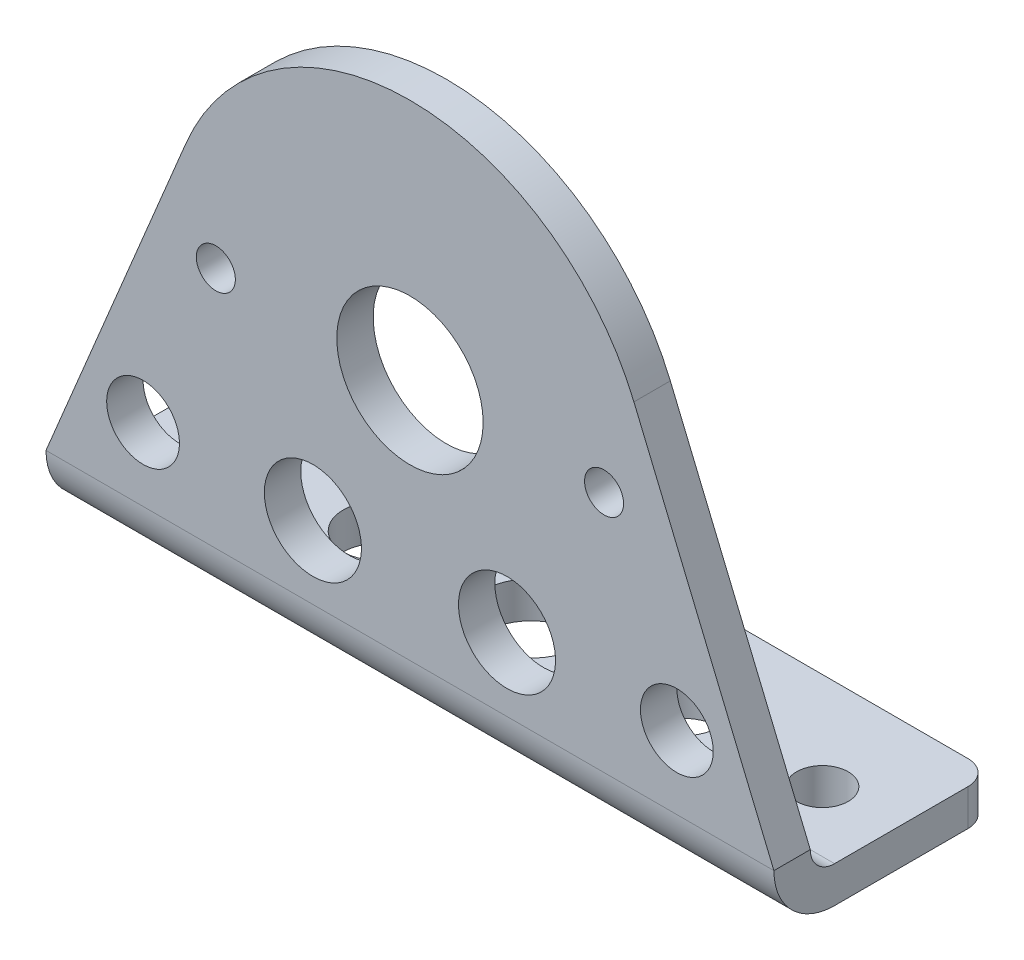
ISO-10303-21;
HEADER;
FILE_DESCRIPTION(('STEP AP214'),'2;1');
FILE_NAME('part.step','',(''),(''),'','','');
FILE_SCHEMA(('AUTOMOTIVE_DESIGN { 1 0 10303 214 1 1 1 1 }'));
ENDSEC;
DATA;
#1=APPLICATION_CONTEXT('core data for automotive mechanical design processes');
#2=APPLICATION_PROTOCOL_DEFINITION('international standard','automotive_design',2000,#1);
#3=PRODUCT_CONTEXT('',#1,'mechanical');
#4=PRODUCT('Part','Part','',(#3));
#5=PRODUCT_RELATED_PRODUCT_CATEGORY('part','',(#4));
#6=PRODUCT_DEFINITION_FORMATION('','',#4);
#7=PRODUCT_DEFINITION_CONTEXT('part definition',#1,'design');
#8=PRODUCT_DEFINITION('design','',#6,#7);
#9=PRODUCT_DEFINITION_SHAPE('','',#8);
#10=(LENGTH_UNIT() NAMED_UNIT(*) SI_UNIT(.MILLI.,.METRE.));
#11=(NAMED_UNIT(*) PLANE_ANGLE_UNIT() SI_UNIT($,.RADIAN.));
#12=(NAMED_UNIT(*) SI_UNIT($,.STERADIAN.) SOLID_ANGLE_UNIT());
#13=UNCERTAINTY_MEASURE_WITH_UNIT(LENGTH_MEASURE(1.E-05),#10,'distance_accuracy_value','');
#14=(GEOMETRIC_REPRESENTATION_CONTEXT(3) GLOBAL_UNCERTAINTY_ASSIGNED_CONTEXT((#13)) GLOBAL_UNIT_ASSIGNED_CONTEXT((#10,
#11,#12)) REPRESENTATION_CONTEXT('',''));
#15=CARTESIAN_POINT('',(0.,0.,0.));
#16=DIRECTION('',(0.,0.,1.));
#17=DIRECTION('',(1.,0.,0.));
#18=AXIS2_PLACEMENT_3D('',#15,#16,#17);
#19=CARTESIAN_POINT('',(47.625,-34.925,-4.7625));
#20=DIRECTION('',(0.,1.,0.));
#21=DIRECTION('',(0.,0.,1.));
#22=AXIS2_PLACEMENT_3D('',#19,#20,#21);
#23=PLANE('',#22);
#24=DIRECTION('',(0.,0.,1.));
#25=VECTOR('',#24,1.);
#26=CARTESIAN_POINT('',(47.625,-34.925,-4.76249999999998));
#27=LINE('',#26,#25);
#28=CARTESIAN_POINT('',(47.625,-34.925,-7.93749999999999));
#29=VERTEX_POINT('',#28);
#30=CARTESIAN_POINT('',(47.625,-34.925,-25.4));
#31=VERTEX_POINT('',#30);
#32=EDGE_CURVE('E95',#29,#31,#27,.F.);
#33=ORIENTED_EDGE('',*,*,#32,.T.);
#34=CARTESIAN_POINT('',(44.45,-34.9250000000001,-25.4));
#35=DIRECTION('',(0.,1.,0.));
#36=DIRECTION('',(0.,0.,1.));
#37=AXIS2_PLACEMENT_3D('',#34,#35,#36);
#38=CIRCLE('',#37,3.175);
#39=CARTESIAN_POINT('',(44.45,-34.9250000000001,-28.575));
#40=VERTEX_POINT('',#39);
#41=EDGE_CURVE('E89',#40,#31,#38,.F.);
#42=ORIENTED_EDGE('',*,*,#41,.F.);
#43=DIRECTION('',(1.,0.,0.));
#44=VECTOR('',#43,1.);
#45=CARTESIAN_POINT('',(47.625,-34.9250000000001,-28.575));
#46=LINE('',#45,#44);
#47=CARTESIAN_POINT('',(-44.45,-34.9250000000001,-28.575));
#48=VERTEX_POINT('',#47);
#49=EDGE_CURVE('E92',#40,#48,#46,.F.);
#50=ORIENTED_EDGE('',*,*,#49,.T.);
#51=CARTESIAN_POINT('',(-44.45,-34.9250000000001,-25.4));
#52=DIRECTION('',(0.,1.,0.));
#53=DIRECTION('',(0.,0.,1.));
#54=AXIS2_PLACEMENT_3D('',#51,#52,#53);
#55=CIRCLE('',#54,3.175);
#56=CARTESIAN_POINT('',(-47.625,-34.9250000000001,-25.4));
#57=VERTEX_POINT('',#56);
#58=EDGE_CURVE('E107',#57,#48,#55,.F.);
#59=ORIENTED_EDGE('',*,*,#58,.F.);
#60=DIRECTION('',(0.,0.,-1.));
#61=VECTOR('',#60,1.);
#62=CARTESIAN_POINT('',(-47.625,-34.9250000000001,-28.575));
#63=LINE('',#62,#61);
#64=CARTESIAN_POINT('',(-47.625,-34.925,-7.93749999999999));
#65=VERTEX_POINT('',#64);
#66=EDGE_CURVE('E120',#57,#65,#63,.F.);
#67=ORIENTED_EDGE('',*,*,#66,.T.);
#68=DIRECTION('',(-1.,0.,0.));
#69=VECTOR('',#68,1.);
#70=CARTESIAN_POINT('',(-47.625,-34.925,-7.93749999999999));
#71=LINE('',#70,#69);
#72=EDGE_CURVE('E119',#65,#29,#71,.F.);
#73=ORIENTED_EDGE('',*,*,#72,.T.);
#74=EDGE_LOOP('',(#33,#42,#50,#59,#67,#73));
#75=FACE_BOUND('',#74,.T.);
#76=CARTESIAN_POINT('',(-38.1,-34.925,-15.875));
#77=DIRECTION('',(0.,1.,0.));
#78=DIRECTION('',(0.,0.,1.));
#79=AXIS2_PLACEMENT_3D('',#76,#77,#78);
#80=CIRCLE('',#79,3.37350099999998);
#81=CARTESIAN_POINT('',(-38.1,-34.925,-12.501499));
#82=VERTEX_POINT('',#81);
#83=EDGE_CURVE('E100',#82,#82,#80,.F.);
#84=ORIENTED_EDGE('',*,*,#83,.T.);
#85=EDGE_LOOP('',(#84));
#86=FACE_BOUND('',#85,.T.);
#87=CARTESIAN_POINT('',(38.1,-34.925,-15.875));
#88=DIRECTION('',(0.,1.,0.));
#89=DIRECTION('',(0.,0.,1.));
#90=AXIS2_PLACEMENT_3D('',#87,#88,#89);
#91=CIRCLE('',#90,3.37350099999999);
#92=CARTESIAN_POINT('',(38.1,-34.925,-12.501499));
#93=VERTEX_POINT('',#92);
#94=EDGE_CURVE('E211',#93,#93,#91,.F.);
#95=ORIENTED_EDGE('',*,*,#94,.T.);
#96=EDGE_LOOP('',(#95));
#97=FACE_BOUND('',#96,.T.);
#98=CARTESIAN_POINT('',(0.,-34.925,-15.875));
#99=DIRECTION('',(0.,1.,0.));
#100=DIRECTION('',(0.,0.,1.));
#101=AXIS2_PLACEMENT_3D('',#98,#99,#100);
#102=CIRCLE('',#101,6.35);
#103=CARTESIAN_POINT('',(0.,-34.925,-9.525));
#104=VERTEX_POINT('',#103);
#105=EDGE_CURVE('E214',#104,#104,#102,.F.);
#106=ORIENTED_EDGE('',*,*,#105,.T.);
#107=EDGE_LOOP('',(#106));
#108=FACE_BOUND('',#107,.T.);
#109=CARTESIAN_POINT('',(-19.84375,-34.925,-15.875));
#110=DIRECTION('',(0.,1.,0.));
#111=DIRECTION('',(0.,0.,1.));
#112=AXIS2_PLACEMENT_3D('',#109,#110,#111);
#113=CIRCLE('',#112,4.7625);
#114=CARTESIAN_POINT('',(-19.84375,-34.925,-11.1125));
#115=VERTEX_POINT('',#114);
#116=EDGE_CURVE('E216',#115,#115,#113,.F.);
#117=ORIENTED_EDGE('',*,*,#116,.T.);
#118=EDGE_LOOP('',(#117));
#119=FACE_BOUND('',#118,.T.);
#120=CARTESIAN_POINT('',(19.84375,-34.925,-15.875));
#121=DIRECTION('',(0.,1.,0.));
#122=DIRECTION('',(0.,0.,1.));
#123=AXIS2_PLACEMENT_3D('',#120,#121,#122);
#124=CIRCLE('',#123,4.76250000000001);
#125=CARTESIAN_POINT('',(19.84375,-34.925,-11.1125));
#126=VERTEX_POINT('',#125);
#127=EDGE_CURVE('E20',#126,#126,#124,.F.);
#128=ORIENTED_EDGE('',*,*,#127,.T.);
#129=EDGE_LOOP('',(#128));
#130=FACE_BOUND('',#129,.T.);
#131=ADVANCED_FACE('F17',(#75,#86,#97,#108,#119,#130),#23,.T.);
#132=CARTESIAN_POINT('',(19.84375,-39.6875000000001,-15.875));
#133=DIRECTION('',(0.,1.,0.));
#134=DIRECTION('',(0.,0.,1.));
#135=AXIS2_PLACEMENT_3D('',#132,#133,#134);
#136=CYLINDRICAL_SURFACE('',#135,4.76250000000001);
#137=CARTESIAN_POINT('',(19.84375,-39.6875000000001,-15.875));
#138=DIRECTION('',(0.,1.,0.));
#139=DIRECTION('',(0.,0.,1.));
#140=AXIS2_PLACEMENT_3D('',#137,#138,#139);
#141=CIRCLE('',#140,4.76250000000001);
#142=CARTESIAN_POINT('',(19.84375,-39.6875000000001,-11.1125));
#143=VERTEX_POINT('',#142);
#144=EDGE_CURVE('E201',#143,#143,#141,.F.);
#145=ORIENTED_EDGE('',*,*,#144,.T.);
#146=EDGE_LOOP('',(#145));
#147=FACE_BOUND('',#146,.T.);
#148=ORIENTED_EDGE('',*,*,#127,.F.);
#149=EDGE_LOOP('',(#148));
#150=FACE_BOUND('',#149,.T.);
#151=ADVANCED_FACE('F224',(#147,#150),#136,.F.);
#152=CARTESIAN_POINT('',(-19.84375,-39.6875000000001,-15.875));
#153=DIRECTION('',(0.,1.,0.));
#154=DIRECTION('',(0.,0.,1.));
#155=AXIS2_PLACEMENT_3D('',#152,#153,#154);
#156=CYLINDRICAL_SURFACE('',#155,4.7625);
#157=CARTESIAN_POINT('',(-19.84375,-39.6875000000001,-15.875));
#158=DIRECTION('',(0.,1.,0.));
#159=DIRECTION('',(0.,0.,1.));
#160=AXIS2_PLACEMENT_3D('',#157,#158,#159);
#161=CIRCLE('',#160,4.7625);
#162=CARTESIAN_POINT('',(-19.84375,-39.6875000000001,-11.1125));
#163=VERTEX_POINT('',#162);
#164=EDGE_CURVE('E198',#163,#163,#161,.F.);
#165=ORIENTED_EDGE('',*,*,#164,.T.);
#166=EDGE_LOOP('',(#165));
#167=FACE_BOUND('',#166,.T.);
#168=ORIENTED_EDGE('',*,*,#116,.F.);
#169=EDGE_LOOP('',(#168));
#170=FACE_BOUND('',#169,.T.);
#171=ADVANCED_FACE('F226',(#167,#170),#156,.F.);
#172=CARTESIAN_POINT('',(0.,-39.6875000000001,-15.875));
#173=DIRECTION('',(0.,1.,0.));
#174=DIRECTION('',(0.,0.,1.));
#175=AXIS2_PLACEMENT_3D('',#172,#173,#174);
#176=CYLINDRICAL_SURFACE('',#175,6.35);
#177=CARTESIAN_POINT('',(0.,-39.6875000000001,-15.875));
#178=DIRECTION('',(0.,1.,0.));
#179=DIRECTION('',(0.,0.,1.));
#180=AXIS2_PLACEMENT_3D('',#177,#178,#179);
#181=CIRCLE('',#180,6.35);
#182=CARTESIAN_POINT('',(0.,-39.6875000000001,-9.52499999999999));
#183=VERTEX_POINT('',#182);
#184=EDGE_CURVE('E195',#183,#183,#181,.F.);
#185=ORIENTED_EDGE('',*,*,#184,.T.);
#186=EDGE_LOOP('',(#185));
#187=FACE_BOUND('',#186,.T.);
#188=ORIENTED_EDGE('',*,*,#105,.F.);
#189=EDGE_LOOP('',(#188));
#190=FACE_BOUND('',#189,.T.);
#191=ADVANCED_FACE('F233',(#187,#190),#176,.F.);
#192=CARTESIAN_POINT('',(38.1,-34.925,-15.875));
#193=DIRECTION('',(0.,1.,0.));
#194=DIRECTION('',(0.,0.,1.));
#195=AXIS2_PLACEMENT_3D('',#192,#193,#194);
#196=CYLINDRICAL_SURFACE('',#195,3.37350099999999);
#197=CARTESIAN_POINT('',(38.1,-39.6875,-15.875));
#198=DIRECTION('',(0.,1.,0.));
#199=DIRECTION('',(0.,0.,1.));
#200=AXIS2_PLACEMENT_3D('',#197,#198,#199);
#201=CIRCLE('',#200,3.37350099999999);
#202=CARTESIAN_POINT('',(38.1,-39.6875,-12.501499));
#203=VERTEX_POINT('',#202);
#204=EDGE_CURVE('E192',#203,#203,#201,.F.);
#205=ORIENTED_EDGE('',*,*,#204,.T.);
#206=EDGE_LOOP('',(#205));
#207=FACE_BOUND('',#206,.T.);
#208=ORIENTED_EDGE('',*,*,#94,.F.);
#209=EDGE_LOOP('',(#208));
#210=FACE_BOUND('',#209,.T.);
#211=ADVANCED_FACE('F319',(#207,#210),#196,.F.);
#212=CARTESIAN_POINT('',(-38.1,-34.925,-15.875));
#213=DIRECTION('',(0.,1.,0.));
#214=DIRECTION('',(0.,0.,1.));
#215=AXIS2_PLACEMENT_3D('',#212,#213,#214);
#216=CYLINDRICAL_SURFACE('',#215,3.37350099999998);
#217=CARTESIAN_POINT('',(-38.1,-39.6875,-15.875));
#218=DIRECTION('',(0.,1.,0.));
#219=DIRECTION('',(0.,0.,1.));
#220=AXIS2_PLACEMENT_3D('',#217,#218,#219);
#221=CIRCLE('',#220,3.37350099999998);
#222=CARTESIAN_POINT('',(-38.1,-39.6875,-12.501499));
#223=VERTEX_POINT('',#222);
#224=EDGE_CURVE('E189',#223,#223,#221,.F.);
#225=ORIENTED_EDGE('',*,*,#224,.T.);
#226=EDGE_LOOP('',(#225));
#227=FACE_BOUND('',#226,.T.);
#228=ORIENTED_EDGE('',*,*,#83,.F.);
#229=EDGE_LOOP('',(#228));
#230=FACE_BOUND('',#229,.T.);
#231=ADVANCED_FACE('F316',(#227,#230),#216,.F.);
#232=CARTESIAN_POINT('',(44.45,-39.6875000000001,-25.4));
#233=DIRECTION('',(0.,1.,0.));
#234=DIRECTION('',(0.,0.,1.));
#235=AXIS2_PLACEMENT_3D('',#232,#233,#234);
#236=CYLINDRICAL_SURFACE('',#235,3.175);
#237=ORIENTED_EDGE('',*,*,#41,.T.);
#238=DIRECTION('',(0.,1.,0.));
#239=VECTOR('',#238,1.);
#240=CARTESIAN_POINT('',(47.625,-39.6875,-25.4));
#241=LINE('',#240,#239);
#242=CARTESIAN_POINT('',(47.625,-39.6875000000001,-25.4));
#243=VERTEX_POINT('',#242);
#244=EDGE_CURVE('E117',#31,#243,#241,.F.);
#245=ORIENTED_EDGE('',*,*,#244,.T.);
#246=CARTESIAN_POINT('',(44.45,-39.6875000000001,-25.4));
#247=DIRECTION('',(0.,1.,0.));
#248=DIRECTION('',(0.,0.,1.));
#249=AXIS2_PLACEMENT_3D('',#246,#247,#248);
#250=CIRCLE('',#249,3.175);
#251=CARTESIAN_POINT('',(44.45,-39.6875000000001,-28.575));
#252=VERTEX_POINT('',#251);
#253=EDGE_CURVE('E112',#243,#252,#250,.T.);
#254=ORIENTED_EDGE('',*,*,#253,.T.);
#255=DIRECTION('',(0.,-1.,0.));
#256=VECTOR('',#255,1.);
#257=CARTESIAN_POINT('',(44.45,-39.6875000000001,-28.575));
#258=LINE('',#257,#256);
#259=EDGE_CURVE('E99',#252,#40,#258,.F.);
#260=ORIENTED_EDGE('',*,*,#259,.T.);
#261=EDGE_LOOP('',(#237,#245,#254,#260));
#262=FACE_BOUND('',#261,.T.);
#263=ADVANCED_FACE('F110',(#262),#236,.T.);
#264=CARTESIAN_POINT('',(47.625,-39.6875000000001,-28.575));
#265=DIRECTION('',(0.,0.,1.));
#266=DIRECTION('',(0.,-1.,0.));
#267=AXIS2_PLACEMENT_3D('',#264,#265,#266);
#268=PLANE('',#267);
#269=DIRECTION('',(0.,1.,0.));
#270=VECTOR('',#269,1.);
#271=CARTESIAN_POINT('',(-44.45,-39.6875000000001,-28.575));
#272=LINE('',#271,#270);
#273=CARTESIAN_POINT('',(-44.45,-39.6875000000001,-28.575));
#274=VERTEX_POINT('',#273);
#275=EDGE_CURVE('E106',#48,#274,#272,.F.);
#276=ORIENTED_EDGE('',*,*,#275,.F.);
#277=ORIENTED_EDGE('',*,*,#49,.F.);
#278=ORIENTED_EDGE('',*,*,#259,.F.);
#279=DIRECTION('',(1.,0.,0.));
#280=VECTOR('',#279,1.);
#281=CARTESIAN_POINT('',(47.625,-39.6875000000001,-28.575));
#282=LINE('',#281,#280);
#283=EDGE_CURVE('E186',#252,#274,#282,.F.);
#284=ORIENTED_EDGE('',*,*,#283,.T.);
#285=EDGE_LOOP('',(#276,#277,#278,#284));
#286=FACE_BOUND('',#285,.T.);
#287=ADVANCED_FACE('F103',(#286),#268,.F.);
#288=CARTESIAN_POINT('',(-44.45,-39.6875000000001,-25.4));
#289=DIRECTION('',(0.,1.,0.));
#290=DIRECTION('',(0.,0.,1.));
#291=AXIS2_PLACEMENT_3D('',#288,#289,#290);
#292=CYLINDRICAL_SURFACE('',#291,3.175);
#293=ORIENTED_EDGE('',*,*,#58,.T.);
#294=ORIENTED_EDGE('',*,*,#275,.T.);
#295=CARTESIAN_POINT('',(-44.45,-39.6875000000001,-25.4));
#296=DIRECTION('',(0.,1.,0.));
#297=DIRECTION('',(0.,0.,1.));
#298=AXIS2_PLACEMENT_3D('',#295,#296,#297);
#299=CIRCLE('',#298,3.175);
#300=CARTESIAN_POINT('',(-47.625,-39.6875000000001,-25.4));
#301=VERTEX_POINT('',#300);
#302=EDGE_CURVE('E183',#274,#301,#299,.T.);
#303=ORIENTED_EDGE('',*,*,#302,.T.);
#304=DIRECTION('',(0.,1.,0.));
#305=VECTOR('',#304,1.);
#306=CARTESIAN_POINT('',(-47.625,-39.6875000000001,-25.4));
#307=LINE('',#306,#305);
#308=EDGE_CURVE('E122',#301,#57,#307,.T.);
#309=ORIENTED_EDGE('',*,*,#308,.T.);
#310=EDGE_LOOP('',(#293,#294,#303,#309));
#311=FACE_BOUND('',#310,.T.);
#312=ADVANCED_FACE('F307',(#311),#292,.T.);
#313=CARTESIAN_POINT('',(-47.625,-31.75,-7.9375));
#314=DIRECTION('',(-1.,0.,0.));
#315=DIRECTION('',(0.,0.,1.));
#316=AXIS2_PLACEMENT_3D('',#313,#314,#315);
#317=CYLINDRICAL_SURFACE('',#316,3.175);
#318=CARTESIAN_POINT('',(47.625,-31.75,-7.9375));
#319=DIRECTION('',(-1.,0.,0.));
#320=DIRECTION('',(0.,0.,1.));
#321=AXIS2_PLACEMENT_3D('',#318,#319,#320);
#322=CIRCLE('',#321,3.175);
#323=CARTESIAN_POINT('',(47.625,-31.75,-4.7625));
#324=VERTEX_POINT('',#323);
#325=EDGE_CURVE('E180',#29,#324,#322,.T.);
#326=ORIENTED_EDGE('',*,*,#325,.F.);
#327=ORIENTED_EDGE('',*,*,#72,.F.);
#328=CARTESIAN_POINT('',(-47.625,-31.75,-7.9375));
#329=DIRECTION('',(-1.,0.,0.));
#330=DIRECTION('',(0.,0.,1.));
#331=AXIS2_PLACEMENT_3D('',#328,#329,#330);
#332=CIRCLE('',#331,3.175);
#333=CARTESIAN_POINT('',(-47.625,-31.75,-4.7625));
#334=VERTEX_POINT('',#333);
#335=EDGE_CURVE('E204',#65,#334,#332,.T.);
#336=ORIENTED_EDGE('',*,*,#335,.T.);
#337=DIRECTION('',(-1.,0.,0.));
#338=VECTOR('',#337,1.);
#339=CARTESIAN_POINT('',(0.,-31.75,-4.7625));
#340=LINE('',#339,#338);
#341=EDGE_CURVE('E207',#324,#334,#340,.T.);
#342=ORIENTED_EDGE('',*,*,#341,.F.);
#343=EDGE_LOOP('',(#326,#327,#336,#342));
#344=FACE_BOUND('',#343,.T.);
#345=ADVANCED_FACE('F303',(#344),#317,.F.);
#346=CARTESIAN_POINT('',(0.,0.,-4.7625));
#347=DIRECTION('',(0.,0.,-1.));
#348=DIRECTION('',(-1.,0.,0.));
#349=AXIS2_PLACEMENT_3D('',#346,#347,#348);
#350=PLANE('',#349);
#351=DIRECTION('',(-0.384615384615385,-0.923076923076923,0.));
#352=VECTOR('',#351,1.);
#353=CARTESIAN_POINT('',(-47.625,-31.75,-4.7625));
#354=LINE('',#353,#352);
#355=CARTESIAN_POINT('',(-29.3076923076923,12.2115384615385,-4.7625));
#356=VERTEX_POINT('',#355);
#357=EDGE_CURVE('E161',#356,#334,#354,.T.);
#358=ORIENTED_EDGE('',*,*,#357,.F.);
#359=CARTESIAN_POINT('',(0.,0.,-4.7625));
#360=DIRECTION('',(0.,0.,1.));
#361=DIRECTION('',(1.,0.,0.));
#362=AXIS2_PLACEMENT_3D('',#359,#360,#361);
#363=CIRCLE('',#362,31.75);
#364=CARTESIAN_POINT('',(29.3076923076923,12.2115384615385,-4.7625));
#365=VERTEX_POINT('',#364);
#366=EDGE_CURVE('E154',#365,#356,#363,.T.);
#367=ORIENTED_EDGE('',*,*,#366,.F.);
#368=DIRECTION('',(-0.384615384615385,0.923076923076923,0.));
#369=VECTOR('',#368,1.);
#370=CARTESIAN_POINT('',(47.625,-31.75,-4.7625));
#371=LINE('',#370,#369);
#372=EDGE_CURVE('E524',#324,#365,#371,.T.);
#373=ORIENTED_EDGE('',*,*,#372,.F.);
#374=ORIENTED_EDGE('',*,*,#341,.T.);
#375=EDGE_LOOP('',(#358,#367,#373,#374));
#376=FACE_BOUND('',#375,.T.);
#377=CARTESIAN_POINT('',(-25.4,0.,-4.7625));
#378=DIRECTION('',(0.,0.,1.));
#379=DIRECTION('',(1.,0.,0.));
#380=AXIS2_PLACEMENT_3D('',#377,#378,#379);
#381=CIRCLE('',#380,2.5527);
#382=CARTESIAN_POINT('',(-22.8473,0.,-4.7625));
#383=VERTEX_POINT('',#382);
#384=EDGE_CURVE('E158',#383,#383,#381,.T.);
#385=ORIENTED_EDGE('',*,*,#384,.T.);
#386=EDGE_LOOP('',(#385));
#387=FACE_BOUND('',#386,.T.);
#388=CARTESIAN_POINT('',(25.4,0.,-4.7625));
#389=DIRECTION('',(0.,0.,1.));
#390=DIRECTION('',(1.,0.,0.));
#391=AXIS2_PLACEMENT_3D('',#388,#389,#390);
#392=CIRCLE('',#391,2.5527);
#393=CARTESIAN_POINT('',(27.9527,0.,-4.7625));
#394=VERTEX_POINT('',#393);
#395=EDGE_CURVE('E162',#394,#394,#392,.T.);
#396=ORIENTED_EDGE('',*,*,#395,.T.);
#397=EDGE_LOOP('',(#396));
#398=FACE_BOUND('',#397,.T.);
#399=CARTESIAN_POINT('',(0.,0.,-4.7625));
#400=DIRECTION('',(0.,0.,1.));
#401=DIRECTION('',(1.,0.,0.));
#402=AXIS2_PLACEMENT_3D('',#399,#400,#401);
#403=CIRCLE('',#402,9.5758);
#404=CARTESIAN_POINT('',(9.5758,0.,-4.7625));
#405=VERTEX_POINT('',#404);
#406=EDGE_CURVE('E165',#405,#405,#403,.T.);
#407=ORIENTED_EDGE('',*,*,#406,.T.);
#408=EDGE_LOOP('',(#407));
#409=FACE_BOUND('',#408,.T.);
#410=CARTESIAN_POINT('',(-12.7,-22.225,-4.7625));
#411=DIRECTION('',(0.,0.,-1.));
#412=DIRECTION('',(-1.,0.,0.));
#413=AXIS2_PLACEMENT_3D('',#410,#411,#412);
#414=CIRCLE('',#413,6.35);
#415=CARTESIAN_POINT('',(-19.05,-22.225,-4.7625));
#416=VERTEX_POINT('',#415);
#417=EDGE_CURVE('E168',#416,#416,#414,.F.);
#418=ORIENTED_EDGE('',*,*,#417,.T.);
#419=EDGE_LOOP('',(#418));
#420=FACE_BOUND('',#419,.T.);
#421=CARTESIAN_POINT('',(12.7,-22.225,-4.7625));
#422=DIRECTION('',(0.,0.,-1.));
#423=DIRECTION('',(-1.,0.,0.));
#424=AXIS2_PLACEMENT_3D('',#421,#422,#423);
#425=CIRCLE('',#424,6.35);
#426=CARTESIAN_POINT('',(6.35,-22.225,-4.7625));
#427=VERTEX_POINT('',#426);
#428=EDGE_CURVE('E171',#427,#427,#425,.F.);
#429=ORIENTED_EDGE('',*,*,#428,.T.);
#430=EDGE_LOOP('',(#429));
#431=FACE_BOUND('',#430,.T.);
#432=CARTESIAN_POINT('',(34.925,-22.225,-4.7625));
#433=DIRECTION('',(0.,0.,-1.));
#434=DIRECTION('',(-1.,0.,0.));
#435=AXIS2_PLACEMENT_3D('',#432,#433,#434);
#436=CIRCLE('',#435,4.7625);
#437=CARTESIAN_POINT('',(30.1625,-22.225,-4.7625));
#438=VERTEX_POINT('',#437);
#439=EDGE_CURVE('E174',#438,#438,#436,.F.);
#440=ORIENTED_EDGE('',*,*,#439,.T.);
#441=EDGE_LOOP('',(#440));
#442=FACE_BOUND('',#441,.T.);
#443=CARTESIAN_POINT('',(-34.925,-22.225,-4.7625));
#444=DIRECTION('',(0.,0.,-1.));
#445=DIRECTION('',(-1.,0.,0.));
#446=AXIS2_PLACEMENT_3D('',#443,#444,#445);
#447=CIRCLE('',#446,4.7625);
#448=CARTESIAN_POINT('',(-39.6875,-22.225,-4.7625));
#449=VERTEX_POINT('',#448);
#450=EDGE_CURVE('E177',#449,#449,#447,.F.);
#451=ORIENTED_EDGE('',*,*,#450,.T.);
#452=EDGE_LOOP('',(#451));
#453=FACE_BOUND('',#452,.T.);
#454=ADVANCED_FACE('F299',(#376,#387,#398,#409,#420,#431,#442,#453),#350,.T.);
#455=CARTESIAN_POINT('',(-47.625,-31.75,-7.9375));
#456=DIRECTION('',(1.,0.,0.));
#457=DIRECTION('',(0.,0.,-1.));
#458=AXIS2_PLACEMENT_3D('',#455,#456,#457);
#459=PLANE('',#458);
#460=ORIENTED_EDGE('',*,*,#335,.F.);
#461=ORIENTED_EDGE('',*,*,#66,.F.);
#462=ORIENTED_EDGE('',*,*,#308,.F.);
#463=DIRECTION('',(0.,0.,1.));
#464=VECTOR('',#463,1.);
#465=CARTESIAN_POINT('',(-47.625,-39.6875,-4.76249999999998));
#466=LINE('',#465,#464);
#467=CARTESIAN_POINT('',(-47.625,-39.6875,-7.93749999999998));
#468=VERTEX_POINT('',#467);
#469=EDGE_CURVE('E182',#301,#468,#466,.T.);
#470=ORIENTED_EDGE('',*,*,#469,.T.);
#471=CARTESIAN_POINT('',(-47.625,-31.75,-7.9375));
#472=DIRECTION('',(-1.,0.,0.));
#473=DIRECTION('',(0.,0.,1.));
#474=AXIS2_PLACEMENT_3D('',#471,#472,#473);
#475=CIRCLE('',#474,7.9375);
#476=CARTESIAN_POINT('',(-47.625,-31.75,0.));
#477=VERTEX_POINT('',#476);
#478=EDGE_CURVE('E151',#477,#468,#475,.F.);
#479=ORIENTED_EDGE('',*,*,#478,.F.);
#480=DIRECTION('',(0.,0.,1.));
#481=VECTOR('',#480,1.);
#482=CARTESIAN_POINT('',(-47.625,-31.75,-4.7625));
#483=LINE('',#482,#481);
#484=EDGE_CURVE('E157',#334,#477,#483,.T.);
#485=ORIENTED_EDGE('',*,*,#484,.F.);
#486=EDGE_LOOP('',(#460,#461,#462,#470,#479,#485));
#487=FACE_BOUND('',#486,.T.);
#488=ADVANCED_FACE('F295',(#487),#459,.F.);
#489=CARTESIAN_POINT('',(47.625,-39.6875,-4.76249999999998));
#490=DIRECTION('',(0.,1.,0.));
#491=DIRECTION('',(0.,0.,1.));
#492=AXIS2_PLACEMENT_3D('',#489,#490,#491);
#493=PLANE('',#492);
#494=ORIENTED_EDGE('',*,*,#302,.F.);
#495=ORIENTED_EDGE('',*,*,#283,.F.);
#496=ORIENTED_EDGE('',*,*,#253,.F.);
#497=DIRECTION('',(0.,0.,1.));
#498=VECTOR('',#497,1.);
#499=CARTESIAN_POINT('',(47.625,-39.6875,-4.76249999999998));
#500=LINE('',#499,#498);
#501=CARTESIAN_POINT('',(47.625,-39.6875,-7.93749999999998));
#502=VERTEX_POINT('',#501);
#503=EDGE_CURVE('E188',#502,#243,#500,.F.);
#504=ORIENTED_EDGE('',*,*,#503,.F.);
#505=DIRECTION('',(-1.,0.,0.));
#506=VECTOR('',#505,1.);
#507=CARTESIAN_POINT('',(-47.625,-39.6875,-7.93749999999998));
#508=LINE('',#507,#506);
#509=EDGE_CURVE('E150',#468,#502,#508,.F.);
#510=ORIENTED_EDGE('',*,*,#509,.F.);
#511=ORIENTED_EDGE('',*,*,#469,.F.);
#512=EDGE_LOOP('',(#494,#495,#496,#504,#510,#511));
#513=FACE_BOUND('',#512,.T.);
#514=ORIENTED_EDGE('',*,*,#224,.F.);
#515=EDGE_LOOP('',(#514));
#516=FACE_BOUND('',#515,.T.);
#517=ORIENTED_EDGE('',*,*,#204,.F.);
#518=EDGE_LOOP('',(#517));
#519=FACE_BOUND('',#518,.T.);
#520=ORIENTED_EDGE('',*,*,#184,.F.);
#521=EDGE_LOOP('',(#520));
#522=FACE_BOUND('',#521,.T.);
#523=ORIENTED_EDGE('',*,*,#164,.F.);
#524=EDGE_LOOP('',(#523));
#525=FACE_BOUND('',#524,.T.);
#526=ORIENTED_EDGE('',*,*,#144,.F.);
#527=EDGE_LOOP('',(#526));
#528=FACE_BOUND('',#527,.T.);
#529=ADVANCED_FACE('F291',(#513,#516,#519,#522,#525,#528),#493,.F.);
#530=CARTESIAN_POINT('',(47.625,-31.75,-7.9375));
#531=DIRECTION('',(1.,0.,0.));
#532=DIRECTION('',(0.,0.,-1.));
#533=AXIS2_PLACEMENT_3D('',#530,#531,#532);
#534=PLANE('',#533);
#535=DIRECTION('',(0.,0.,1.));
#536=VECTOR('',#535,1.);
#537=CARTESIAN_POINT('',(47.625,-31.75,-4.7625));
#538=LINE('',#537,#536);
#539=CARTESIAN_POINT('',(47.625,-31.75,0.));
#540=VERTEX_POINT('',#539);
#541=EDGE_CURVE('E526',#540,#324,#538,.F.);
#542=ORIENTED_EDGE('',*,*,#541,.F.);
#543=CARTESIAN_POINT('',(47.625,-31.75,-7.9375));
#544=DIRECTION('',(-1.,0.,0.));
#545=DIRECTION('',(0.,0.,1.));
#546=AXIS2_PLACEMENT_3D('',#543,#544,#545);
#547=CIRCLE('',#546,7.9375);
#548=EDGE_CURVE('E34',#502,#540,#547,.T.);
#549=ORIENTED_EDGE('',*,*,#548,.F.);
#550=ORIENTED_EDGE('',*,*,#503,.T.);
#551=ORIENTED_EDGE('',*,*,#244,.F.);
#552=ORIENTED_EDGE('',*,*,#32,.F.);
#553=ORIENTED_EDGE('',*,*,#325,.T.);
#554=EDGE_LOOP('',(#542,#549,#550,#551,#552,#553));
#555=FACE_BOUND('',#554,.T.);
#556=ADVANCED_FACE('F287',(#555),#534,.T.);
#557=CARTESIAN_POINT('',(-34.925,-22.225,0.));
#558=DIRECTION('',(0.,0.,-1.));
#559=DIRECTION('',(-1.,0.,0.));
#560=AXIS2_PLACEMENT_3D('',#557,#558,#559);
#561=CYLINDRICAL_SURFACE('',#560,4.7625);
#562=CARTESIAN_POINT('',(-34.925,-22.225,0.));
#563=DIRECTION('',(0.,0.,-1.));
#564=DIRECTION('',(-1.,0.,0.));
#565=AXIS2_PLACEMENT_3D('',#562,#563,#564);
#566=CIRCLE('',#565,4.7625);
#567=CARTESIAN_POINT('',(-39.6875,-22.225,0.));
#568=VERTEX_POINT('',#567);
#569=EDGE_CURVE('E146',#568,#568,#566,.F.);
#570=ORIENTED_EDGE('',*,*,#569,.T.);
#571=EDGE_LOOP('',(#570));
#572=FACE_BOUND('',#571,.T.);
#573=ORIENTED_EDGE('',*,*,#450,.F.);
#574=EDGE_LOOP('',(#573));
#575=FACE_BOUND('',#574,.T.);
#576=ADVANCED_FACE('F283',(#572,#575),#561,.F.);
#577=CARTESIAN_POINT('',(34.925,-22.225,0.));
#578=DIRECTION('',(0.,0.,-1.));
#579=DIRECTION('',(-1.,0.,0.));
#580=AXIS2_PLACEMENT_3D('',#577,#578,#579);
#581=CYLINDRICAL_SURFACE('',#580,4.7625);
#582=CARTESIAN_POINT('',(34.925,-22.225,0.));
#583=DIRECTION('',(0.,0.,-1.));
#584=DIRECTION('',(-1.,0.,0.));
#585=AXIS2_PLACEMENT_3D('',#582,#583,#584);
#586=CIRCLE('',#585,4.7625);
#587=CARTESIAN_POINT('',(30.1625,-22.225,0.));
#588=VERTEX_POINT('',#587);
#589=EDGE_CURVE('E143',#588,#588,#586,.F.);
#590=ORIENTED_EDGE('',*,*,#589,.T.);
#591=EDGE_LOOP('',(#590));
#592=FACE_BOUND('',#591,.T.);
#593=ORIENTED_EDGE('',*,*,#439,.F.);
#594=EDGE_LOOP('',(#593));
#595=FACE_BOUND('',#594,.T.);
#596=ADVANCED_FACE('F279',(#592,#595),#581,.F.);
#597=CARTESIAN_POINT('',(12.7,-22.225,0.));
#598=DIRECTION('',(0.,0.,-1.));
#599=DIRECTION('',(-1.,0.,0.));
#600=AXIS2_PLACEMENT_3D('',#597,#598,#599);
#601=CYLINDRICAL_SURFACE('',#600,6.35);
#602=CARTESIAN_POINT('',(12.7,-22.225,0.));
#603=DIRECTION('',(0.,0.,-1.));
#604=DIRECTION('',(-1.,0.,0.));
#605=AXIS2_PLACEMENT_3D('',#602,#603,#604);
#606=CIRCLE('',#605,6.35);
#607=CARTESIAN_POINT('',(6.35,-22.225,0.));
#608=VERTEX_POINT('',#607);
#609=EDGE_CURVE('E140',#608,#608,#606,.F.);
#610=ORIENTED_EDGE('',*,*,#609,.T.);
#611=EDGE_LOOP('',(#610));
#612=FACE_BOUND('',#611,.T.);
#613=ORIENTED_EDGE('',*,*,#428,.F.);
#614=EDGE_LOOP('',(#613));
#615=FACE_BOUND('',#614,.T.);
#616=ADVANCED_FACE('F275',(#612,#615),#601,.F.);
#617=CARTESIAN_POINT('',(-12.7,-22.225,0.));
#618=DIRECTION('',(0.,0.,-1.));
#619=DIRECTION('',(-1.,0.,0.));
#620=AXIS2_PLACEMENT_3D('',#617,#618,#619);
#621=CYLINDRICAL_SURFACE('',#620,6.35);
#622=CARTESIAN_POINT('',(-12.7,-22.225,0.));
#623=DIRECTION('',(0.,0.,-1.));
#624=DIRECTION('',(-1.,0.,0.));
#625=AXIS2_PLACEMENT_3D('',#622,#623,#624);
#626=CIRCLE('',#625,6.35);
#627=CARTESIAN_POINT('',(-19.05,-22.225,0.));
#628=VERTEX_POINT('',#627);
#629=EDGE_CURVE('E137',#628,#628,#626,.F.);
#630=ORIENTED_EDGE('',*,*,#629,.T.);
#631=EDGE_LOOP('',(#630));
#632=FACE_BOUND('',#631,.T.);
#633=ORIENTED_EDGE('',*,*,#417,.F.);
#634=EDGE_LOOP('',(#633));
#635=FACE_BOUND('',#634,.T.);
#636=ADVANCED_FACE('F271',(#632,#635),#621,.F.);
#637=CARTESIAN_POINT('',(0.,0.,-4.7625));
#638=DIRECTION('',(0.,0.,1.));
#639=DIRECTION('',(1.,0.,0.));
#640=AXIS2_PLACEMENT_3D('',#637,#638,#639);
#641=CYLINDRICAL_SURFACE('',#640,9.5758);
#642=ORIENTED_EDGE('',*,*,#406,.F.);
#643=EDGE_LOOP('',(#642));
#644=FACE_BOUND('',#643,.T.);
#645=CARTESIAN_POINT('',(0.,0.,0.));
#646=DIRECTION('',(0.,0.,1.));
#647=DIRECTION('',(1.,0.,0.));
#648=AXIS2_PLACEMENT_3D('',#645,#646,#647);
#649=CIRCLE('',#648,9.5758);
#650=CARTESIAN_POINT('',(9.5758,0.,0.));
#651=VERTEX_POINT('',#650);
#652=EDGE_CURVE('E134',#651,#651,#649,.T.);
#653=ORIENTED_EDGE('',*,*,#652,.T.);
#654=EDGE_LOOP('',(#653));
#655=FACE_BOUND('',#654,.T.);
#656=ADVANCED_FACE('F267',(#644,#655),#641,.F.);
#657=CARTESIAN_POINT('',(25.4,0.,-4.7625));
#658=DIRECTION('',(0.,0.,1.));
#659=DIRECTION('',(1.,0.,0.));
#660=AXIS2_PLACEMENT_3D('',#657,#658,#659);
#661=CYLINDRICAL_SURFACE('',#660,2.5527);
#662=ORIENTED_EDGE('',*,*,#395,.F.);
#663=EDGE_LOOP('',(#662));
#664=FACE_BOUND('',#663,.T.);
#665=CARTESIAN_POINT('',(25.4,0.,0.));
#666=DIRECTION('',(0.,0.,1.));
#667=DIRECTION('',(1.,0.,0.));
#668=AXIS2_PLACEMENT_3D('',#665,#666,#667);
#669=CIRCLE('',#668,2.5527);
#670=CARTESIAN_POINT('',(27.9527,0.,0.));
#671=VERTEX_POINT('',#670);
#672=EDGE_CURVE('E131',#671,#671,#669,.T.);
#673=ORIENTED_EDGE('',*,*,#672,.T.);
#674=EDGE_LOOP('',(#673));
#675=FACE_BOUND('',#674,.T.);
#676=ADVANCED_FACE('F263',(#664,#675),#661,.F.);
#677=CARTESIAN_POINT('',(-25.4,0.,-4.7625));
#678=DIRECTION('',(0.,0.,1.));
#679=DIRECTION('',(1.,0.,0.));
#680=AXIS2_PLACEMENT_3D('',#677,#678,#679);
#681=CYLINDRICAL_SURFACE('',#680,2.5527);
#682=ORIENTED_EDGE('',*,*,#384,.F.);
#683=EDGE_LOOP('',(#682));
#684=FACE_BOUND('',#683,.T.);
#685=CARTESIAN_POINT('',(-25.4,0.,0.));
#686=DIRECTION('',(0.,0.,1.));
#687=DIRECTION('',(1.,0.,0.));
#688=AXIS2_PLACEMENT_3D('',#685,#686,#687);
#689=CIRCLE('',#688,2.5527);
#690=CARTESIAN_POINT('',(-22.8473,0.,0.));
#691=VERTEX_POINT('',#690);
#692=EDGE_CURVE('E128',#691,#691,#689,.T.);
#693=ORIENTED_EDGE('',*,*,#692,.T.);
#694=EDGE_LOOP('',(#693));
#695=FACE_BOUND('',#694,.T.);
#696=ADVANCED_FACE('F259',(#684,#695),#681,.F.);
#697=CARTESIAN_POINT('',(-47.625,-31.75,-4.7625));
#698=DIRECTION('',(-0.923076923076923,0.384615384615385,0.));
#699=DIRECTION('',(-0.384615384615385,-0.923076923076923,0.));
#700=AXIS2_PLACEMENT_3D('',#697,#698,#699);
#701=PLANE('',#700);
#702=ORIENTED_EDGE('',*,*,#357,.T.);
#703=ORIENTED_EDGE('',*,*,#484,.T.);
#704=DIRECTION('',(0.384615384615384,0.923076923076923,0.));
#705=VECTOR('',#704,1.);
#706=CARTESIAN_POINT('',(-47.625,-31.75,0.));
#707=LINE('',#706,#705);
#708=CARTESIAN_POINT('',(-29.3076923076923,12.2115384615385,0.));
#709=VERTEX_POINT('',#708);
#710=EDGE_CURVE('E127',#477,#709,#707,.T.);
#711=ORIENTED_EDGE('',*,*,#710,.T.);
#712=DIRECTION('',(0.,0.,1.));
#713=VECTOR('',#712,1.);
#714=CARTESIAN_POINT('',(-29.3076923076923,12.2115384615385,-4.7625));
#715=LINE('',#714,#713);
#716=EDGE_CURVE('E156',#356,#709,#715,.T.);
#717=ORIENTED_EDGE('',*,*,#716,.F.);
#718=EDGE_LOOP('',(#702,#703,#711,#717));
#719=FACE_BOUND('',#718,.T.);
#720=ADVANCED_FACE('F255',(#719),#701,.T.);
#721=CARTESIAN_POINT('',(0.,0.,-4.7625));
#722=DIRECTION('',(0.,0.,1.));
#723=DIRECTION('',(1.,0.,0.));
#724=AXIS2_PLACEMENT_3D('',#721,#722,#723);
#725=CYLINDRICAL_SURFACE('',#724,31.75);
#726=ORIENTED_EDGE('',*,*,#366,.T.);
#727=ORIENTED_EDGE('',*,*,#716,.T.);
#728=CARTESIAN_POINT('',(0.,0.,0.));
#729=DIRECTION('',(0.,0.,1.));
#730=DIRECTION('',(1.,0.,0.));
#731=AXIS2_PLACEMENT_3D('',#728,#729,#730);
#732=CIRCLE('',#731,31.75);
#733=CARTESIAN_POINT('',(29.3076923076923,12.2115384615385,0.));
#734=VERTEX_POINT('',#733);
#735=EDGE_CURVE('E124',#709,#734,#732,.F.);
#736=ORIENTED_EDGE('',*,*,#735,.T.);
#737=DIRECTION('',(0.,0.,1.));
#738=VECTOR('',#737,1.);
#739=CARTESIAN_POINT('',(29.3076923076923,12.2115384615385,-4.7625));
#740=LINE('',#739,#738);
#741=EDGE_CURVE('E153',#365,#734,#740,.T.);
#742=ORIENTED_EDGE('',*,*,#741,.F.);
#743=EDGE_LOOP('',(#726,#727,#736,#742));
#744=FACE_BOUND('',#743,.T.);
#745=ADVANCED_FACE('F251',(#744),#725,.T.);
#746=CARTESIAN_POINT('',(47.625,-31.75,-4.7625));
#747=DIRECTION('',(0.923076923076923,0.384615384615385,0.));
#748=DIRECTION('',(-0.384615384615385,0.923076923076923,0.));
#749=AXIS2_PLACEMENT_3D('',#746,#747,#748);
#750=PLANE('',#749);
#751=ORIENTED_EDGE('',*,*,#372,.T.);
#752=ORIENTED_EDGE('',*,*,#741,.T.);
#753=DIRECTION('',(0.384615384615385,-0.923076923076923,0.));
#754=VECTOR('',#753,1.);
#755=CARTESIAN_POINT('',(29.3076923076923,12.2115384615385,0.));
#756=LINE('',#755,#754);
#757=EDGE_CURVE('E26',#734,#540,#756,.T.);
#758=ORIENTED_EDGE('',*,*,#757,.T.);
#759=ORIENTED_EDGE('',*,*,#541,.T.);
#760=EDGE_LOOP('',(#751,#752,#758,#759));
#761=FACE_BOUND('',#760,.T.);
#762=ADVANCED_FACE('F244',(#761),#750,.T.);
#763=CARTESIAN_POINT('',(-47.625,-31.75,-7.9375));
#764=DIRECTION('',(-1.,0.,0.));
#765=DIRECTION('',(0.,0.,1.));
#766=AXIS2_PLACEMENT_3D('',#763,#764,#765);
#767=CYLINDRICAL_SURFACE('',#766,7.9375);
#768=ORIENTED_EDGE('',*,*,#509,.T.);
#769=ORIENTED_EDGE('',*,*,#548,.T.);
#770=DIRECTION('',(-1.,0.,0.));
#771=VECTOR('',#770,1.);
#772=CARTESIAN_POINT('',(0.,-31.75,0.));
#773=LINE('',#772,#771);
#774=EDGE_CURVE('E10',#540,#477,#773,.T.);
#775=ORIENTED_EDGE('',*,*,#774,.T.);
#776=ORIENTED_EDGE('',*,*,#478,.T.);
#777=EDGE_LOOP('',(#768,#769,#775,#776));
#778=FACE_BOUND('',#777,.T.);
#779=ADVANCED_FACE('F238',(#778),#767,.T.);
#780=CARTESIAN_POINT('',(0.,0.,0.));
#781=DIRECTION('',(0.,0.,-1.));
#782=DIRECTION('',(-1.,0.,0.));
#783=AXIS2_PLACEMENT_3D('',#780,#781,#782);
#784=PLANE('',#783);
#785=ORIENTED_EDGE('',*,*,#757,.F.);
#786=ORIENTED_EDGE('',*,*,#735,.F.);
#787=ORIENTED_EDGE('',*,*,#710,.F.);
#788=ORIENTED_EDGE('',*,*,#774,.F.);
#789=EDGE_LOOP('',(#785,#786,#787,#788));
#790=FACE_BOUND('',#789,.T.);
#791=ORIENTED_EDGE('',*,*,#692,.F.);
#792=EDGE_LOOP('',(#791));
#793=FACE_BOUND('',#792,.T.);
#794=ORIENTED_EDGE('',*,*,#672,.F.);
#795=EDGE_LOOP('',(#794));
#796=FACE_BOUND('',#795,.T.);
#797=ORIENTED_EDGE('',*,*,#652,.F.);
#798=EDGE_LOOP('',(#797));
#799=FACE_BOUND('',#798,.T.);
#800=ORIENTED_EDGE('',*,*,#629,.F.);
#801=EDGE_LOOP('',(#800));
#802=FACE_BOUND('',#801,.T.);
#803=ORIENTED_EDGE('',*,*,#609,.F.);
#804=EDGE_LOOP('',(#803));
#805=FACE_BOUND('',#804,.T.);
#806=ORIENTED_EDGE('',*,*,#589,.F.);
#807=EDGE_LOOP('',(#806));
#808=FACE_BOUND('',#807,.T.);
#809=ORIENTED_EDGE('',*,*,#569,.F.);
#810=EDGE_LOOP('',(#809));
#811=FACE_BOUND('',#810,.T.);
#812=ADVANCED_FACE('F236',(#790,#793,#796,#799,#802,#805,#808,#811),#784,.F.);
#813=CLOSED_SHELL('',(#131,#151,#171,#191,#211,#231,#263,#287,#312,#345,#454,#488,#529,#556,
#576,#596,#616,#636,#656,#676,#696,#720,#745,#762,#779,#812));
#814=MANIFOLD_SOLID_BREP('B1',#813);
#815=ADVANCED_BREP_SHAPE_REPRESENTATION('',(#18,#814),#14);
#816=SHAPE_DEFINITION_REPRESENTATION(#9,#815);
ENDSEC;
END-ISO-10303-21;
